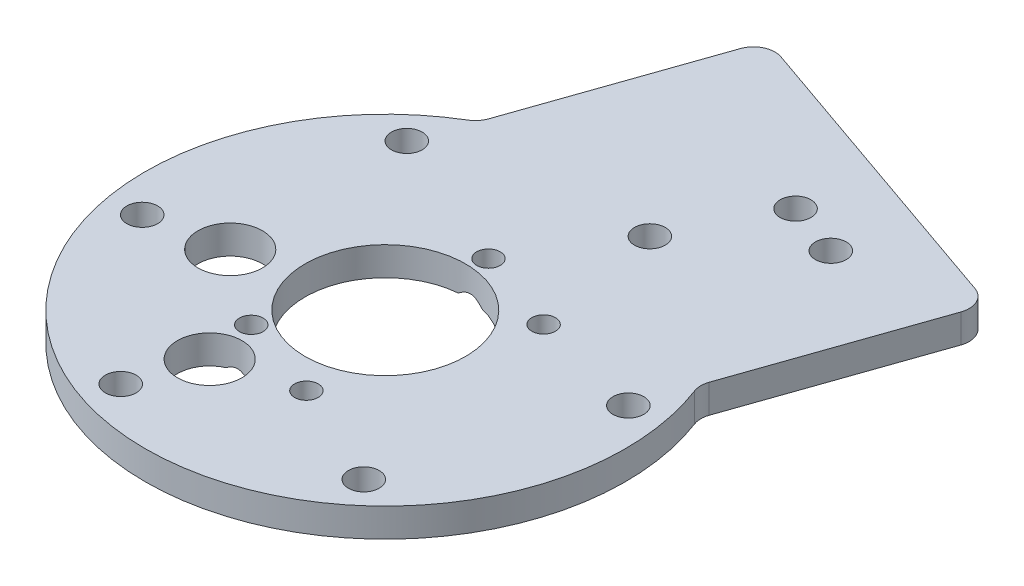
ISO-10303-21;
HEADER;
FILE_DESCRIPTION(('STEP AP214'),'2;1');
FILE_NAME('part.step','',(''),(''),'','','');
FILE_SCHEMA(('AUTOMOTIVE_DESIGN { 1 0 10303 214 1 1 1 1 }'));
ENDSEC;
DATA;
#1=APPLICATION_CONTEXT('core data for automotive mechanical design processes');
#2=APPLICATION_PROTOCOL_DEFINITION('international standard','automotive_design',2000,#1);
#3=PRODUCT_CONTEXT('',#1,'mechanical');
#4=PRODUCT('Part','Part','',(#3));
#5=PRODUCT_RELATED_PRODUCT_CATEGORY('part','',(#4));
#6=PRODUCT_DEFINITION_FORMATION('','',#4);
#7=PRODUCT_DEFINITION_CONTEXT('part definition',#1,'design');
#8=PRODUCT_DEFINITION('design','',#6,#7);
#9=PRODUCT_DEFINITION_SHAPE('','',#8);
#10=(LENGTH_UNIT() NAMED_UNIT(*) SI_UNIT(.MILLI.,.METRE.));
#11=(NAMED_UNIT(*) PLANE_ANGLE_UNIT() SI_UNIT($,.RADIAN.));
#12=(NAMED_UNIT(*) SI_UNIT($,.STERADIAN.) SOLID_ANGLE_UNIT());
#13=UNCERTAINTY_MEASURE_WITH_UNIT(LENGTH_MEASURE(1.E-05),#10,'distance_accuracy_value','');
#14=(GEOMETRIC_REPRESENTATION_CONTEXT(3) GLOBAL_UNCERTAINTY_ASSIGNED_CONTEXT((#13)) GLOBAL_UNIT_ASSIGNED_CONTEXT((#10,
#11,#12)) REPRESENTATION_CONTEXT('',''));
#15=CARTESIAN_POINT('',(0.,0.,0.));
#16=DIRECTION('',(0.,0.,1.));
#17=DIRECTION('',(1.,0.,0.));
#18=AXIS2_PLACEMENT_3D('',#15,#16,#17);
#19=CARTESIAN_POINT('',(0.,4.,0.));
#20=DIRECTION('',(0.,1.,0.));
#21=DIRECTION('',(0.,0.,1.));
#22=AXIS2_PLACEMENT_3D('',#19,#20,#21);
#23=PLANE('',#22);
#24=CARTESIAN_POINT('',(16.3561252008861,4.,-40.8959309517822));
#25=DIRECTION('',(0.,1.,0.));
#26=DIRECTION('',(0.,0.,1.));
#27=AXIS2_PLACEMENT_3D('',#24,#25,#26);
#28=CIRCLE('',#27,2.15);
#29=CARTESIAN_POINT('',(16.3561252008861,4.,-38.7459309517822));
#30=VERTEX_POINT('',#29);
#31=EDGE_CURVE('E387',#30,#30,#28,.F.);
#32=ORIENTED_EDGE('',*,*,#31,.T.);
#33=EDGE_LOOP('',(#32));
#34=FACE_BOUND('',#33,.T.);
#35=CARTESIAN_POINT('',(23.9113137051343,4.,-38.2655076654505));
#36=DIRECTION('',(0.,1.,0.));
#37=DIRECTION('',(0.,0.,1.));
#38=AXIS2_PLACEMENT_3D('',#35,#36,#37);
#39=CIRCLE('',#38,2.15);
#40=CARTESIAN_POINT('',(23.9113137051343,4.,-36.1155076654505));
#41=VERTEX_POINT('',#40);
#42=EDGE_CURVE('E715',#41,#41,#39,.F.);
#43=ORIENTED_EDGE('',*,*,#42,.T.);
#44=EDGE_LOOP('',(#43));
#45=FACE_BOUND('',#44,.T.);
#46=CARTESIAN_POINT('',(28.4859634660655,4.,-5.43598063002285));
#47=DIRECTION('',(0.,1.,0.));
#48=DIRECTION('',(0.,0.,1.));
#49=AXIS2_PLACEMENT_3D('',#46,#47,#48);
#50=CIRCLE('',#49,2.15);
#51=CARTESIAN_POINT('',(28.4859634660655,4.,-3.28598063002285));
#52=VERTEX_POINT('',#51);
#53=EDGE_CURVE('E231',#52,#52,#50,.T.);
#54=ORIENTED_EDGE('',*,*,#53,.F.);
#55=EDGE_LOOP('',(#54));
#56=FACE_BOUND('',#55,.T.);
#57=DIRECTION('',(-0.328802910791456,0.,0.944398563031025));
#58=VECTOR('',#57,1.);
#59=CARTESIAN_POINT('',(23.6099640757756,4.,8.22007276978641));
#60=LINE('',#59,#58);
#61=CARTESIAN_POINT('',(40.3789125261399,4.,-39.9442539447959));
#62=VERTEX_POINT('',#61);
#63=CARTESIAN_POINT('',(31.3087983972791,4.,-13.8927730463911));
#64=VERTEX_POINT('',#63);
#65=EDGE_CURVE('E361',#62,#64,#60,.T.);
#66=ORIENTED_EDGE('',*,*,#65,.F.);
#67=CARTESIAN_POINT('',(37.5457168370468,4.,-40.9306626771703));
#68=DIRECTION('',(0.,1.,0.));
#69=DIRECTION('',(0.,0.,1.));
#70=AXIS2_PLACEMENT_3D('',#67,#68,#69);
#71=CIRCLE('',#70,3.);
#72=CARTESIAN_POINT('',(38.5321255694212,4.,-43.7638583662633));
#73=VERTEX_POINT('',#72);
#74=EDGE_CURVE('E339',#62,#73,#71,.T.);
#75=ORIENTED_EDGE('',*,*,#74,.T.);
#76=DIRECTION('',(0.944398563031025,0.,0.328802910791456));
#77=VECTOR('',#76,1.);
#78=CARTESIAN_POINT('',(17.7553571827386,4.,-50.9975224036754));
#79=LINE('',#78,#77);
#80=CARTESIAN_POINT('',(-3.02141120394394,4.,-58.2311864410874));
#81=VERTEX_POINT('',#80);
#82=EDGE_CURVE('E396',#81,#73,#79,.T.);
#83=ORIENTED_EDGE('',*,*,#82,.F.);
#84=CARTESIAN_POINT('',(-4.0078199363183,4.,-55.3979907519943));
#85=DIRECTION('',(0.,1.,0.));
#86=DIRECTION('',(0.,0.,1.));
#87=AXIS2_PLACEMENT_3D('',#84,#85,#86);
#88=CIRCLE('',#87,3.);
#89=CARTESIAN_POINT('',(-6.84101562541137,4.,-56.3843994843687));
#90=VERTEX_POINT('',#89);
#91=EDGE_CURVE('E108',#81,#90,#88,.T.);
#92=ORIENTED_EDGE('',*,*,#91,.T.);
#93=DIRECTION('',(0.328802910791456,0.,-0.944398563031026));
#94=VECTOR('',#93,1.);
#95=CARTESIAN_POINT('',(-23.6099640757756,4.,-8.2200727697864));
#96=LINE('',#95,#94);
#97=CARTESIAN_POINT('',(-15.9111297542721,4.,-30.3329185859639));
#98=VERTEX_POINT('',#97);
#99=EDGE_CURVE('E370',#98,#90,#96,.T.);
#100=ORIENTED_EDGE('',*,*,#99,.F.);
#101=CARTESIAN_POINT('',(-18.7443254433652,4.,-31.3193273183383));
#102=DIRECTION('',(0.,1.,0.));
#103=DIRECTION('',(0.,0.,1.));
#104=AXIS2_PLACEMENT_3D('',#101,#102,#103);
#105=CIRCLE('',#104,3.);
#106=CARTESIAN_POINT('',(-17.2036959548694,4.,-28.7451360318995));
#107=VERTEX_POINT('',#106);
#108=EDGE_CURVE('E12',#98,#107,#105,.F.);
#109=ORIENTED_EDGE('',*,*,#108,.T.);
#110=CARTESIAN_POINT('',(0.,4.,0.));
#111=DIRECTION('',(0.,1.,0.));
#112=DIRECTION('',(0.,0.,1.));
#113=AXIS2_PLACEMENT_3D('',#110,#111,#112);
#114=CIRCLE('',#113,33.5);
#115=CARTESIAN_POINT('',(31.3358027916019,4.,-11.8455672471113));
#116=VERTEX_POINT('',#115);
#117=EDGE_CURVE('E245',#107,#116,#114,.T.);
#118=ORIENTED_EDGE('',*,*,#117,.T.);
#119=CARTESIAN_POINT('',(34.1419940863722,4.,-12.9063643140168));
#120=DIRECTION('',(0.,1.,0.));
#121=DIRECTION('',(0.,0.,1.));
#122=AXIS2_PLACEMENT_3D('',#119,#120,#121);
#123=CIRCLE('',#122,3.);
#124=EDGE_CURVE('E351',#116,#64,#123,.F.);
#125=ORIENTED_EDGE('',*,*,#124,.T.);
#126=EDGE_LOOP('',(#66,#75,#83,#92,#100,#109,#118,#125));
#127=FACE_BOUND('',#126,.T.);
#128=CARTESIAN_POINT('',(-18.9506790531127,4.,-21.9515776978767));
#129=DIRECTION('',(0.,1.,0.));
#130=DIRECTION('',(0.,0.,1.));
#131=AXIS2_PLACEMENT_3D('',#128,#129,#130);
#132=CIRCLE('',#131,2.15);
#133=CARTESIAN_POINT('',(-18.9506790531127,4.,-19.8015776978767));
#134=VERTEX_POINT('',#133);
#135=EDGE_CURVE('E230',#134,#134,#132,.T.);
#136=ORIENTED_EDGE('',*,*,#135,.F.);
#137=EDGE_LOOP('',(#136));
#138=FACE_BOUND('',#137,.T.);
#139=CARTESIAN_POINT('',(0.,4.,0.));
#140=DIRECTION('',(0.,1.,0.));
#141=DIRECTION('',(0.,0.,1.));
#142=AXIS2_PLACEMENT_3D('',#139,#140,#141);
#143=CIRCLE('',#142,11.2);
#144=CARTESIAN_POINT('',(0.,4.,11.2));
#145=VERTEX_POINT('',#144);
#146=EDGE_CURVE('E200',#145,#145,#143,.T.);
#147=ORIENTED_EDGE('',*,*,#146,.F.);
#148=EDGE_LOOP('',(#147));
#149=FACE_BOUND('',#148,.T.);
#150=CARTESIAN_POINT('',(-6.32945603273559,4.,18.1796723383468));
#151=DIRECTION('',(0.,1.,0.));
#152=DIRECTION('',(0.,0.,1.));
#153=AXIS2_PLACEMENT_3D('',#150,#151,#152);
#154=CIRCLE('',#153,4.5);
#155=CARTESIAN_POINT('',(-6.32945603273559,4.,22.6796723383468));
#156=VERTEX_POINT('',#155);
#157=EDGE_CURVE('E202',#156,#156,#154,.T.);
#158=ORIENTED_EDGE('',*,*,#157,.F.);
#159=EDGE_LOOP('',(#158));
#160=FACE_BOUND('',#159,.T.);
#161=CARTESIAN_POINT('',(-7.57983281090142,4.,11.1263711316335));
#162=DIRECTION('',(0.,-1.,0.));
#163=DIRECTION('',(0.,0.,-1.));
#164=AXIS2_PLACEMENT_3D('',#161,#162,#163);
#165=CIRCLE('',#164,1.65);
#166=CARTESIAN_POINT('',(-7.57983281090142,4.,9.47637113163352));
#167=VERTEX_POINT('',#166);
#168=EDGE_CURVE('E426',#167,#167,#165,.T.);
#169=ORIENTED_EDGE('',*,*,#168,.T.);
#170=EDGE_LOOP('',(#169));
#171=FACE_BOUND('',#170,.T.);
#172=CARTESIAN_POINT('',(12.774024907565,4.,-9.31795512228199));
#173=DIRECTION('',(0.,-1.,0.));
#174=DIRECTION('',(0.,0.,-1.));
#175=AXIS2_PLACEMENT_3D('',#172,#173,#174);
#176=CIRCLE('',#175,1.65);
#177=CARTESIAN_POINT('',(12.774024907565,4.,-10.967955122282));
#178=VERTEX_POINT('',#177);
#179=EDGE_CURVE('E196',#178,#178,#176,.T.);
#180=ORIENTED_EDGE('',*,*,#179,.T.);
#181=EDGE_LOOP('',(#180));
#182=FACE_BOUND('',#181,.T.);
#183=CARTESIAN_POINT('',(0.969042869677158,4.,-13.4279915071752));
#184=DIRECTION('',(0.,-1.,0.));
#185=DIRECTION('',(0.,0.,-1.));
#186=AXIS2_PLACEMENT_3D('',#183,#184,#185);
#187=CIRCLE('',#186,1.65);
#188=CARTESIAN_POINT('',(0.969042869677158,4.,-15.0779915071752));
#189=VERTEX_POINT('',#188);
#190=EDGE_CURVE('E409',#189,#189,#187,.T.);
#191=ORIENTED_EDGE('',*,*,#190,.T.);
#192=EDGE_LOOP('',(#191));
#193=FACE_BOUND('',#192,.T.);
#194=CARTESIAN_POINT('',(9.53528441295281,4.,-27.3875583278995));
#195=DIRECTION('',(0.,1.,0.));
#196=DIRECTION('',(0.,0.,1.));
#197=AXIS2_PLACEMENT_3D('',#194,#195,#196);
#198=CIRCLE('',#197,2.15);
#199=CARTESIAN_POINT('',(9.53528441295281,4.,-25.2375583278995));
#200=VERTEX_POINT('',#199);
#201=EDGE_CURVE('E227',#200,#200,#198,.T.);
#202=ORIENTED_EDGE('',*,*,#201,.F.);
#203=EDGE_LOOP('',(#202));
#204=FACE_BOUND('',#203,.T.);
#205=CARTESIAN_POINT('',(18.9506790531127,4.,21.9515776978767));
#206=DIRECTION('',(0.,1.,0.));
#207=DIRECTION('',(0.,0.,1.));
#208=AXIS2_PLACEMENT_3D('',#205,#206,#207);
#209=CIRCLE('',#208,2.15);
#210=CARTESIAN_POINT('',(18.9506790531127,4.,24.1015776978767));
#211=VERTEX_POINT('',#210);
#212=EDGE_CURVE('E234',#211,#211,#209,.T.);
#213=ORIENTED_EDGE('',*,*,#212,.F.);
#214=EDGE_LOOP('',(#213));
#215=FACE_BOUND('',#214,.T.);
#216=CARTESIAN_POINT('',(-9.53528441295281,4.,27.3875583278995));
#217=DIRECTION('',(0.,1.,0.));
#218=DIRECTION('',(0.,0.,1.));
#219=AXIS2_PLACEMENT_3D('',#216,#217,#218);
#220=CIRCLE('',#219,2.15);
#221=CARTESIAN_POINT('',(-9.53528441295281,4.,29.5375583278995));
#222=VERTEX_POINT('',#221);
#223=EDGE_CURVE('E237',#222,#222,#220,.T.);
#224=ORIENTED_EDGE('',*,*,#223,.F.);
#225=EDGE_LOOP('',(#224));
#226=FACE_BOUND('',#225,.T.);
#227=CARTESIAN_POINT('',(-28.4859634660655,4.,5.43598063002286));
#228=DIRECTION('',(0.,1.,0.));
#229=DIRECTION('',(0.,0.,1.));
#230=AXIS2_PLACEMENT_3D('',#227,#228,#229);
#231=CIRCLE('',#230,2.15);
#232=CARTESIAN_POINT('',(-28.4859634660655,4.,7.58598063002286));
#233=VERTEX_POINT('',#232);
#234=EDGE_CURVE('E218',#233,#233,#231,.T.);
#235=ORIENTED_EDGE('',*,*,#234,.F.);
#236=EDGE_LOOP('',(#235));
#237=FACE_BOUND('',#236,.T.);
#238=CARTESIAN_POINT('',(-18.1720801421436,4.,3.46778074673733));
#239=DIRECTION('',(0.,1.,0.));
#240=DIRECTION('',(0.,0.,1.));
#241=AXIS2_PLACEMENT_3D('',#238,#239,#240);
#242=CIRCLE('',#241,4.5);
#243=CARTESIAN_POINT('',(-18.1720801421436,4.,7.96778074673733));
#244=VERTEX_POINT('',#243);
#245=EDGE_CURVE('E219',#244,#244,#242,.T.);
#246=ORIENTED_EDGE('',*,*,#245,.F.);
#247=EDGE_LOOP('',(#246));
#248=FACE_BOUND('',#247,.T.);
#249=CARTESIAN_POINT('',(4.22514922698641,4.,15.2364075165266));
#250=DIRECTION('',(0.,-1.,0.));
#251=DIRECTION('',(0.,0.,-1.));
#252=AXIS2_PLACEMENT_3D('',#249,#250,#251);
#253=CIRCLE('',#252,1.65);
#254=CARTESIAN_POINT('',(4.22514922698641,4.,13.5864075165266));
#255=VERTEX_POINT('',#254);
#256=EDGE_CURVE('E418',#255,#255,#253,.T.);
#257=ORIENTED_EDGE('',*,*,#256,.T.);
#258=EDGE_LOOP('',(#257));
#259=FACE_BOUND('',#258,.T.);
#260=ADVANCED_FACE('F93',(#34,#45,#56,#127,#138,#149,#160,#171,#182,#193,#204,#215,#226,#237,
#248,#259),#23,.T.);
#261=CARTESIAN_POINT('',(0.,4.,0.));
#262=DIRECTION('',(0.,-1.,0.));
#263=DIRECTION('',(0.,0.,-1.));
#264=AXIS2_PLACEMENT_3D('',#261,#262,#263);
#265=CYLINDRICAL_SURFACE('',#264,33.5);
#266=CARTESIAN_POINT('',(0.,0.,0.));
#267=DIRECTION('',(0.,1.,0.));
#268=DIRECTION('',(0.,0.,1.));
#269=AXIS2_PLACEMENT_3D('',#266,#267,#268);
#270=CIRCLE('',#269,33.5);
#271=CARTESIAN_POINT('',(-17.2036959548694,0.,-28.7451360318995));
#272=VERTEX_POINT('',#271);
#273=CARTESIAN_POINT('',(31.3358027916019,0.,-11.8455672471113));
#274=VERTEX_POINT('',#273);
#275=EDGE_CURVE('E248',#272,#274,#270,.T.);
#276=ORIENTED_EDGE('',*,*,#275,.T.);
#277=DIRECTION('',(0.,-1.,0.));
#278=VECTOR('',#277,1.);
#279=CARTESIAN_POINT('',(31.3358027916019,4.,-11.8455672471113));
#280=LINE('',#279,#278);
#281=EDGE_CURVE('E372',#274,#116,#280,.F.);
#282=ORIENTED_EDGE('',*,*,#281,.T.);
#283=ORIENTED_EDGE('',*,*,#117,.F.);
#284=DIRECTION('',(0.,-1.,0.));
#285=VECTOR('',#284,1.);
#286=CARTESIAN_POINT('',(-17.2036959548694,4.,-28.7451360318995));
#287=LINE('',#286,#285);
#288=EDGE_CURVE('E365',#107,#272,#287,.T.);
#289=ORIENTED_EDGE('',*,*,#288,.T.);
#290=EDGE_LOOP('',(#276,#282,#283,#289));
#291=FACE_BOUND('',#290,.T.);
#292=ADVANCED_FACE('F301',(#291),#265,.T.);
#293=CARTESIAN_POINT('',(0.,0.,0.));
#294=DIRECTION('',(0.,1.,0.));
#295=DIRECTION('',(0.,0.,1.));
#296=AXIS2_PLACEMENT_3D('',#293,#294,#295);
#297=PLANE('',#296);
#298=CARTESIAN_POINT('',(16.3561252008861,0.,-40.8959309517822));
#299=DIRECTION('',(0.,-1.,0.));
#300=DIRECTION('',(0.,0.,-1.));
#301=AXIS2_PLACEMENT_3D('',#298,#299,#300);
#302=CIRCLE('',#301,2.15);
#303=CARTESIAN_POINT('',(16.3561252008861,0.,-43.0459309517822));
#304=VERTEX_POINT('',#303);
#305=EDGE_CURVE('E391',#304,#304,#302,.T.);
#306=ORIENTED_EDGE('',*,*,#305,.F.);
#307=EDGE_LOOP('',(#306));
#308=FACE_BOUND('',#307,.T.);
#309=CARTESIAN_POINT('',(23.9113137051343,0.,-38.2655076654505));
#310=DIRECTION('',(0.,-1.,0.));
#311=DIRECTION('',(0.,0.,-1.));
#312=AXIS2_PLACEMENT_3D('',#309,#310,#311);
#313=CIRCLE('',#312,2.15);
#314=CARTESIAN_POINT('',(23.9113137051343,0.,-40.4155076654505));
#315=VERTEX_POINT('',#314);
#316=EDGE_CURVE('E718',#315,#315,#313,.T.);
#317=ORIENTED_EDGE('',*,*,#316,.F.);
#318=EDGE_LOOP('',(#317));
#319=FACE_BOUND('',#318,.T.);
#320=CARTESIAN_POINT('',(28.4859634660655,0.,-5.43598063002285));
#321=DIRECTION('',(0.,1.,0.));
#322=DIRECTION('',(0.,0.,1.));
#323=AXIS2_PLACEMENT_3D('',#320,#321,#322);
#324=CIRCLE('',#323,2.15);
#325=CARTESIAN_POINT('',(28.4859634660655,0.,-3.28598063002285));
#326=VERTEX_POINT('',#325);
#327=EDGE_CURVE('E257',#326,#326,#324,.T.);
#328=ORIENTED_EDGE('',*,*,#327,.T.);
#329=EDGE_LOOP('',(#328));
#330=FACE_BOUND('',#329,.T.);
#331=DIRECTION('',(0.944398563031026,0.,0.328802910791456));
#332=VECTOR('',#331,1.);
#333=CARTESIAN_POINT('',(17.7553571827386,0.,-50.9975224036754));
#334=LINE('',#333,#332);
#335=CARTESIAN_POINT('',(-3.02141120394394,0.,-58.2311864410874));
#336=VERTEX_POINT('',#335);
#337=CARTESIAN_POINT('',(38.5321255694212,0.,-43.7638583662633));
#338=VERTEX_POINT('',#337);
#339=EDGE_CURVE('E382',#336,#338,#334,.T.);
#340=ORIENTED_EDGE('',*,*,#339,.T.);
#341=CARTESIAN_POINT('',(37.5457168370468,0.,-40.9306626771703));
#342=DIRECTION('',(0.,1.,0.));
#343=DIRECTION('',(0.,0.,1.));
#344=AXIS2_PLACEMENT_3D('',#341,#342,#343);
#345=CIRCLE('',#344,3.);
#346=CARTESIAN_POINT('',(40.3789125261399,0.,-39.9442539447959));
#347=VERTEX_POINT('',#346);
#348=EDGE_CURVE('E340',#338,#347,#345,.F.);
#349=ORIENTED_EDGE('',*,*,#348,.T.);
#350=DIRECTION('',(-0.328802910791456,0.,0.944398563031025));
#351=VECTOR('',#350,1.);
#352=CARTESIAN_POINT('',(23.6099640757756,0.,8.22007276978641));
#353=LINE('',#352,#351);
#354=CARTESIAN_POINT('',(31.3087983972791,0.,-13.8927730463911));
#355=VERTEX_POINT('',#354);
#356=EDGE_CURVE('E362',#347,#355,#353,.T.);
#357=ORIENTED_EDGE('',*,*,#356,.T.);
#358=CARTESIAN_POINT('',(34.1419940863722,0.,-12.9063643140168));
#359=DIRECTION('',(0.,1.,0.));
#360=DIRECTION('',(0.,0.,1.));
#361=AXIS2_PLACEMENT_3D('',#358,#359,#360);
#362=CIRCLE('',#361,3.);
#363=EDGE_CURVE('E349',#355,#274,#362,.T.);
#364=ORIENTED_EDGE('',*,*,#363,.T.);
#365=ORIENTED_EDGE('',*,*,#275,.F.);
#366=CARTESIAN_POINT('',(-18.7443254433652,0.,-31.3193273183383));
#367=DIRECTION('',(0.,1.,0.));
#368=DIRECTION('',(0.,0.,1.));
#369=AXIS2_PLACEMENT_3D('',#366,#367,#368);
#370=CIRCLE('',#369,3.);
#371=CARTESIAN_POINT('',(-15.9111297542721,0.,-30.3329185859639));
#372=VERTEX_POINT('',#371);
#373=EDGE_CURVE('E101',#272,#372,#370,.T.);
#374=ORIENTED_EDGE('',*,*,#373,.T.);
#375=DIRECTION('',(0.328802910791456,0.,-0.944398563031026));
#376=VECTOR('',#375,1.);
#377=CARTESIAN_POINT('',(-23.6099640757756,0.,-8.2200727697864));
#378=LINE('',#377,#376);
#379=CARTESIAN_POINT('',(-6.84101562541137,0.,-56.3843994843687));
#380=VERTEX_POINT('',#379);
#381=EDGE_CURVE('E357',#372,#380,#378,.T.);
#382=ORIENTED_EDGE('',*,*,#381,.T.);
#383=CARTESIAN_POINT('',(-4.0078199363183,0.,-55.3979907519943));
#384=DIRECTION('',(0.,1.,0.));
#385=DIRECTION('',(0.,0.,1.));
#386=AXIS2_PLACEMENT_3D('',#383,#384,#385);
#387=CIRCLE('',#386,3.);
#388=EDGE_CURVE('E343',#380,#336,#387,.F.);
#389=ORIENTED_EDGE('',*,*,#388,.T.);
#390=EDGE_LOOP('',(#340,#349,#357,#364,#365,#374,#382,#389));
#391=FACE_BOUND('',#390,.T.);
#392=CARTESIAN_POINT('',(-18.9506790531127,0.,-21.9515776978767));
#393=DIRECTION('',(0.,1.,0.));
#394=DIRECTION('',(0.,0.,1.));
#395=AXIS2_PLACEMENT_3D('',#392,#393,#394);
#396=CIRCLE('',#395,2.15);
#397=CARTESIAN_POINT('',(-18.9506790531127,0.,-19.8015776978767));
#398=VERTEX_POINT('',#397);
#399=EDGE_CURVE('E244',#398,#398,#396,.T.);
#400=ORIENTED_EDGE('',*,*,#399,.T.);
#401=EDGE_LOOP('',(#400));
#402=FACE_BOUND('',#401,.T.);
#403=CARTESIAN_POINT('',(0.,0.,0.));
#404=DIRECTION('',(0.,1.,0.));
#405=DIRECTION('',(0.,0.,1.));
#406=AXIS2_PLACEMENT_3D('',#403,#404,#405);
#407=CIRCLE('',#406,11.2);
#408=CARTESIAN_POINT('',(-0.990215530630316,0.,-11.1561406051958));
#409=VERTEX_POINT('',#408);
#410=CARTESIAN_POINT('',(-7.70454024181279,0.,8.12896424289635));
#411=VERTEX_POINT('',#410);
#412=EDGE_CURVE('E191',#409,#411,#407,.T.);
#413=ORIENTED_EDGE('',*,*,#412,.T.);
#414=CARTESIAN_POINT('',(-7.57983281090142,0.,11.1263711316335));
#415=DIRECTION('',(0.,-1.,0.));
#416=DIRECTION('',(0.,0.,-1.));
#417=AXIS2_PLACEMENT_3D('',#414,#415,#416);
#418=CIRCLE('',#417,3.);
#419=CARTESIAN_POINT('',(-8.16142767085961,0.,14.0694558091225));
#420=VERTEX_POINT('',#419);
#421=EDGE_CURVE('E421',#420,#411,#418,.T.);
#422=ORIENTED_EDGE('',*,*,#421,.F.);
#423=CARTESIAN_POINT('',(-6.32945603273559,0.,18.1796723383468));
#424=DIRECTION('',(0.,1.,0.));
#425=DIRECTION('',(0.,0.,1.));
#426=AXIS2_PLACEMENT_3D('',#423,#424,#425);
#427=CIRCLE('',#426,4.5);
#428=CARTESIAN_POINT('',(-6.02199980867246,0.,13.6901878835029));
#429=VERTEX_POINT('',#428);
#430=EDGE_CURVE('E222',#420,#429,#427,.T.);
#431=ORIENTED_EDGE('',*,*,#430,.T.);
#432=CARTESIAN_POINT('',(-4.74478626564165,0.,10.1452946380762));
#433=VERTEX_POINT('',#432);
#434=EDGE_CURVE('E422',#433,#429,#418,.T.);
#435=ORIENTED_EDGE('',*,*,#434,.F.);
#436=CARTESIAN_POINT('',(2.58179827200503,0.,-10.8983630735387));
#437=VERTEX_POINT('',#436);
#438=EDGE_CURVE('E194',#433,#437,#407,.T.);
#439=ORIENTED_EDGE('',*,*,#438,.T.);
#440=CARTESIAN_POINT('',(0.969042869677158,0.,-13.4279915071752));
#441=DIRECTION('',(0.,-1.,0.));
#442=DIRECTION('',(0.,0.,-1.));
#443=AXIS2_PLACEMENT_3D('',#440,#441,#442);
#444=CIRCLE('',#443,3.);
#445=EDGE_CURVE('E180',#409,#437,#444,.T.);
#446=ORIENTED_EDGE('',*,*,#445,.F.);
#447=EDGE_LOOP('',(#413,#422,#431,#435,#439,#446));
#448=FACE_BOUND('',#447,.T.);
#449=CARTESIAN_POINT('',(4.22514922698641,0.,15.2364075165266));
#450=DIRECTION('',(0.,-1.,0.));
#451=DIRECTION('',(0.,0.,-1.));
#452=AXIS2_PLACEMENT_3D('',#449,#450,#451);
#453=CIRCLE('',#452,3.);
#454=CARTESIAN_POINT('',(4.22514922698641,0.,12.2364075165266));
#455=VERTEX_POINT('',#454);
#456=EDGE_CURVE('E412',#455,#455,#453,.T.);
#457=ORIENTED_EDGE('',*,*,#456,.F.);
#458=EDGE_LOOP('',(#457));
#459=FACE_BOUND('',#458,.T.);
#460=CARTESIAN_POINT('',(-18.1720801421436,0.,3.46778074673733));
#461=DIRECTION('',(0.,1.,0.));
#462=DIRECTION('',(0.,0.,1.));
#463=AXIS2_PLACEMENT_3D('',#460,#461,#462);
#464=CIRCLE('',#463,4.5);
#465=CARTESIAN_POINT('',(-18.1720801421436,0.,7.96778074673733));
#466=VERTEX_POINT('',#465);
#467=EDGE_CURVE('E215',#466,#466,#464,.T.);
#468=ORIENTED_EDGE('',*,*,#467,.T.);
#469=EDGE_LOOP('',(#468));
#470=FACE_BOUND('',#469,.T.);
#471=CARTESIAN_POINT('',(-28.4859634660655,0.,5.43598063002286));
#472=DIRECTION('',(0.,1.,0.));
#473=DIRECTION('',(0.,0.,1.));
#474=AXIS2_PLACEMENT_3D('',#471,#472,#473);
#475=CIRCLE('',#474,2.15);
#476=CARTESIAN_POINT('',(-28.4859634660655,0.,7.58598063002286));
#477=VERTEX_POINT('',#476);
#478=EDGE_CURVE('E251',#477,#477,#475,.T.);
#479=ORIENTED_EDGE('',*,*,#478,.T.);
#480=EDGE_LOOP('',(#479));
#481=FACE_BOUND('',#480,.T.);
#482=CARTESIAN_POINT('',(-9.53528441295281,0.,27.3875583278995));
#483=DIRECTION('',(0.,1.,0.));
#484=DIRECTION('',(0.,0.,1.));
#485=AXIS2_PLACEMENT_3D('',#482,#483,#484);
#486=CIRCLE('',#485,2.15);
#487=CARTESIAN_POINT('',(-9.53528441295281,0.,29.5375583278995));
#488=VERTEX_POINT('',#487);
#489=EDGE_CURVE('E263',#488,#488,#486,.T.);
#490=ORIENTED_EDGE('',*,*,#489,.T.);
#491=EDGE_LOOP('',(#490));
#492=FACE_BOUND('',#491,.T.);
#493=CARTESIAN_POINT('',(18.9506790531127,0.,21.9515776978767));
#494=DIRECTION('',(0.,1.,0.));
#495=DIRECTION('',(0.,0.,1.));
#496=AXIS2_PLACEMENT_3D('',#493,#494,#495);
#497=CIRCLE('',#496,2.15);
#498=CARTESIAN_POINT('',(18.9506790531127,0.,24.1015776978767));
#499=VERTEX_POINT('',#498);
#500=EDGE_CURVE('E260',#499,#499,#497,.T.);
#501=ORIENTED_EDGE('',*,*,#500,.T.);
#502=EDGE_LOOP('',(#501));
#503=FACE_BOUND('',#502,.T.);
#504=CARTESIAN_POINT('',(9.53528441295281,0.,-27.3875583278995));
#505=DIRECTION('',(0.,1.,0.));
#506=DIRECTION('',(0.,0.,1.));
#507=AXIS2_PLACEMENT_3D('',#504,#505,#506);
#508=CIRCLE('',#507,2.15);
#509=CARTESIAN_POINT('',(9.53528441295281,0.,-25.2375583278995));
#510=VERTEX_POINT('',#509);
#511=EDGE_CURVE('E254',#510,#510,#508,.T.);
#512=ORIENTED_EDGE('',*,*,#511,.T.);
#513=EDGE_LOOP('',(#512));
#514=FACE_BOUND('',#513,.T.);
#515=CARTESIAN_POINT('',(12.774024907565,0.,-9.31795512228199));
#516=DIRECTION('',(0.,-1.,0.));
#517=DIRECTION('',(0.,0.,-1.));
#518=AXIS2_PLACEMENT_3D('',#515,#516,#517);
#519=CIRCLE('',#518,3.);
#520=CARTESIAN_POINT('',(12.774024907565,0.,-12.317955122282));
#521=VERTEX_POINT('',#520);
#522=EDGE_CURVE('E398',#521,#521,#519,.T.);
#523=ORIENTED_EDGE('',*,*,#522,.F.);
#524=EDGE_LOOP('',(#523));
#525=FACE_BOUND('',#524,.T.);
#526=ADVANCED_FACE('F188',(#308,#319,#330,#391,#402,#448,#459,#470,#481,#492,#503,#514,#525),
#297,.F.);
#527=CARTESIAN_POINT('',(-18.9506790531127,-20.,-21.9515776978767));
#528=DIRECTION('',(0.,1.,0.));
#529=DIRECTION('',(0.,0.,1.));
#530=AXIS2_PLACEMENT_3D('',#527,#528,#529);
#531=CYLINDRICAL_SURFACE('',#530,2.15);
#532=ORIENTED_EDGE('',*,*,#135,.T.);
#533=EDGE_LOOP('',(#532));
#534=FACE_BOUND('',#533,.T.);
#535=ORIENTED_EDGE('',*,*,#399,.F.);
#536=EDGE_LOOP('',(#535));
#537=FACE_BOUND('',#536,.T.);
#538=ADVANCED_FACE('F314',(#534,#537),#531,.F.);
#539=CARTESIAN_POINT('',(9.53528441295281,-20.,-27.3875583278995));
#540=DIRECTION('',(0.,1.,0.));
#541=DIRECTION('',(0.,0.,1.));
#542=AXIS2_PLACEMENT_3D('',#539,#540,#541);
#543=CYLINDRICAL_SURFACE('',#542,2.15);
#544=ORIENTED_EDGE('',*,*,#201,.T.);
#545=EDGE_LOOP('',(#544));
#546=FACE_BOUND('',#545,.T.);
#547=ORIENTED_EDGE('',*,*,#511,.F.);
#548=EDGE_LOOP('',(#547));
#549=FACE_BOUND('',#548,.T.);
#550=ADVANCED_FACE('F521',(#546,#549),#543,.F.);
#551=CARTESIAN_POINT('',(28.4859634660655,-20.,-5.43598063002285));
#552=DIRECTION('',(0.,1.,0.));
#553=DIRECTION('',(0.,0.,1.));
#554=AXIS2_PLACEMENT_3D('',#551,#552,#553);
#555=CYLINDRICAL_SURFACE('',#554,2.15);
#556=ORIENTED_EDGE('',*,*,#53,.T.);
#557=EDGE_LOOP('',(#556));
#558=FACE_BOUND('',#557,.T.);
#559=ORIENTED_EDGE('',*,*,#327,.F.);
#560=EDGE_LOOP('',(#559));
#561=FACE_BOUND('',#560,.T.);
#562=ADVANCED_FACE('F527',(#558,#561),#555,.F.);
#563=CARTESIAN_POINT('',(18.9506790531127,-20.,21.9515776978767));
#564=DIRECTION('',(0.,1.,0.));
#565=DIRECTION('',(0.,0.,1.));
#566=AXIS2_PLACEMENT_3D('',#563,#564,#565);
#567=CYLINDRICAL_SURFACE('',#566,2.15);
#568=ORIENTED_EDGE('',*,*,#212,.T.);
#569=EDGE_LOOP('',(#568));
#570=FACE_BOUND('',#569,.T.);
#571=ORIENTED_EDGE('',*,*,#500,.F.);
#572=EDGE_LOOP('',(#571));
#573=FACE_BOUND('',#572,.T.);
#574=ADVANCED_FACE('F530',(#570,#573),#567,.F.);
#575=CARTESIAN_POINT('',(-9.53528441295281,-20.,27.3875583278995));
#576=DIRECTION('',(0.,1.,0.));
#577=DIRECTION('',(0.,0.,1.));
#578=AXIS2_PLACEMENT_3D('',#575,#576,#577);
#579=CYLINDRICAL_SURFACE('',#578,2.15);
#580=ORIENTED_EDGE('',*,*,#223,.T.);
#581=EDGE_LOOP('',(#580));
#582=FACE_BOUND('',#581,.T.);
#583=ORIENTED_EDGE('',*,*,#489,.F.);
#584=EDGE_LOOP('',(#583));
#585=FACE_BOUND('',#584,.T.);
#586=ADVANCED_FACE('F633',(#582,#585),#579,.F.);
#587=CARTESIAN_POINT('',(-28.4859634660655,-20.,5.43598063002286));
#588=DIRECTION('',(0.,1.,0.));
#589=DIRECTION('',(0.,0.,1.));
#590=AXIS2_PLACEMENT_3D('',#587,#588,#589);
#591=CYLINDRICAL_SURFACE('',#590,2.15);
#592=ORIENTED_EDGE('',*,*,#234,.T.);
#593=EDGE_LOOP('',(#592));
#594=FACE_BOUND('',#593,.T.);
#595=ORIENTED_EDGE('',*,*,#478,.F.);
#596=EDGE_LOOP('',(#595));
#597=FACE_BOUND('',#596,.T.);
#598=ADVANCED_FACE('F437',(#594,#597),#591,.F.);
#599=CARTESIAN_POINT('',(-6.32945603273559,0.,18.1796723383468));
#600=DIRECTION('',(0.,1.,0.));
#601=DIRECTION('',(0.,0.,1.));
#602=AXIS2_PLACEMENT_3D('',#599,#600,#601);
#603=CYLINDRICAL_SURFACE('',#602,4.5);
#604=ORIENTED_EDGE('',*,*,#430,.F.);
#605=CARTESIAN_POINT('',(-8.16174452346892,-0.00020000000000047,14.0695970486804));
#606=CARTESIAN_POINT('',(-8.06484145810903,0.0609726425144009,14.0263563699747));
#607=CARTESIAN_POINT('',(-7.96285005495678,0.117596678613043,13.9850402317614));
#608=CARTESIAN_POINT('',(-7.74848908094933,0.215447663379432,13.9077414549993));
#609=CARTESIAN_POINT('',(-7.63601626776637,0.256495472066935,13.8718235802537));
#610=CARTESIAN_POINT('',(-7.43321253865754,0.307537075139783,13.8162242411453));
#611=CARTESIAN_POINT('',(-7.3447846025454,0.322845060036785,13.7947532355617));
#612=CARTESIAN_POINT('',(-7.16604162552522,0.338384840784985,13.7571846459147));
#613=CARTESIAN_POINT('',(-7.07574232772437,0.338712712175901,13.7410534777604));
#614=CARTESIAN_POINT('',(-6.89565047067019,0.324500116636169,13.7145058071818));
#615=CARTESIAN_POINT('',(-6.8058574114573,0.309978641861595,13.7040820312129));
#616=CARTESIAN_POINT('',(-6.62838983773297,0.268093639649458,13.688721737527));
#617=CARTESIAN_POINT('',(-6.54073090610416,0.240655018015356,13.6838178829155));
#618=CARTESIAN_POINT('',(-6.37943780713918,0.179797901922384,13.6793139374491));
#619=CARTESIAN_POINT('',(-6.30538244842859,0.147491197049042,13.679148309828));
#620=CARTESIAN_POINT('',(-6.16097849980457,0.0773621022481874,13.6822563137011));
#621=CARTESIAN_POINT('',(-6.09059827666652,0.0396037548149205,13.6854924310141));
#622=CARTESIAN_POINT('',(-6.02165371363389,-0.000200000000028218,13.6902115987529));
#623=B_SPLINE_CURVE_WITH_KNOTS('',3,(#605,#606,#607,#608,#609,#610,#611,#612,#613,#614,#615,
#616,#617,#618,#619,#620,#621,#622),.UNSPECIFIED.,.F.,.F.,(4,2,2,2,2,2,2,2,4),(0.,
0.368985446945573,0.742094445398462,1.01761569152284,1.29136962171363,1.56477386092259,
1.83978755105083,2.08181954728654,2.32121015876595),.UNSPECIFIED.);
#624=EDGE_CURVE('E204',#420,#429,#623,.T.);
#625=ORIENTED_EDGE('',*,*,#624,.T.);
#626=EDGE_LOOP('',(#604,#625));
#627=FACE_BOUND('',#626,.T.);
#628=ORIENTED_EDGE('',*,*,#157,.T.);
#629=EDGE_LOOP('',(#628));
#630=FACE_BOUND('',#629,.T.);
#631=ADVANCED_FACE('F432',(#627,#630),#603,.F.);
#632=CARTESIAN_POINT('',(-18.1720801421436,0.,3.46778074673733));
#633=DIRECTION('',(0.,1.,0.));
#634=DIRECTION('',(0.,0.,1.));
#635=AXIS2_PLACEMENT_3D('',#632,#633,#634);
#636=CYLINDRICAL_SURFACE('',#635,4.5);
#637=ORIENTED_EDGE('',*,*,#467,.F.);
#638=EDGE_LOOP('',(#637));
#639=FACE_BOUND('',#638,.T.);
#640=ORIENTED_EDGE('',*,*,#245,.T.);
#641=EDGE_LOOP('',(#640));
#642=FACE_BOUND('',#641,.T.);
#643=ADVANCED_FACE('F436',(#639,#642),#636,.F.);
#644=CARTESIAN_POINT('',(0.,0.,0.));
#645=DIRECTION('',(0.,1.,0.));
#646=DIRECTION('',(0.,0.,1.));
#647=AXIS2_PLACEMENT_3D('',#644,#645,#646);
#648=CYLINDRICAL_SURFACE('',#647,11.2);
#649=ORIENTED_EDGE('',*,*,#146,.T.);
#650=EDGE_LOOP('',(#649));
#651=FACE_BOUND('',#650,.T.);
#652=CARTESIAN_POINT('',(-4.74453377257196,-0.000200000000001332,10.1454127210737));
#653=CARTESIAN_POINT('',(-4.81313352346863,0.0540805407247798,10.113324306019));
#654=CARTESIAN_POINT('',(-4.88222661705322,0.107198093889317,10.080171916277));
#655=CARTESIAN_POINT('',(-5.02193073321672,0.210248743264971,10.0113105463179));
#656=CARTESIAN_POINT('',(-5.09254625452358,0.260169931609948,9.97559295128671));
#657=CARTESIAN_POINT('',(-5.23729856638955,0.35687567948566,9.90038024454487));
#658=CARTESIAN_POINT('',(-5.31147884281887,0.403537129908889,9.86080854149232));
#659=CARTESIAN_POINT('',(-5.46169744891598,0.490405115342623,9.77840408556674));
#660=CARTESIAN_POINT('',(-5.53773301148625,0.530620658296247,9.73557600906245));
#661=CARTESIAN_POINT('',(-5.66183549329927,0.588418297457506,9.66367308286959));
#662=CARTESIAN_POINT('',(-5.70928545814363,0.608721849875333,9.63572335523145));
#663=CARTESIAN_POINT('',(-5.80486563136725,0.645469657107595,9.57844653805835));
#664=CARTESIAN_POINT('',(-5.85299585806872,0.661913807761839,9.54911941137482));
#665=CARTESIAN_POINT('',(-5.94933644091024,0.690187670897239,9.4893929410023));
#666=CARTESIAN_POINT('',(-5.99754237574582,0.702056665472047,9.45900528499716));
#667=CARTESIAN_POINT('',(-6.09415772121572,0.720837187768296,9.39704914763288));
#668=CARTESIAN_POINT('',(-6.1425670786592,0.72774993907073,9.36548095974582));
#669=CARTESIAN_POINT('',(-6.23972848894629,0.73630308684354,9.30103335945209));
#670=CARTESIAN_POINT('',(-6.28847875224237,0.737886955878245,9.26814361122823));
#671=CARTESIAN_POINT('',(-6.38536196856586,0.735533039784333,9.20166313880563));
#672=CARTESIAN_POINT('',(-6.433494916353,0.731595207814203,9.16807240866273));
#673=CARTESIAN_POINT('',(-6.52888854680799,0.718398480891082,9.10038715952167));
#674=CARTESIAN_POINT('',(-6.57614595058385,0.709122622365206,9.06629137365075));
#675=CARTESIAN_POINT('',(-6.66935385443555,0.685707525870747,8.99794774457364));
#676=CARTESIAN_POINT('',(-6.71530349181725,0.671565154594134,8.96369981746876));
#677=CARTESIAN_POINT('',(-6.82466571317765,0.63220195854385,8.88090156544531));
#678=CARTESIAN_POINT('',(-6.88731946865609,0.604822437421369,8.83237718413559));
#679=CARTESIAN_POINT('',(-7.00949922190891,0.543314265539345,8.73573114569181));
#680=CARTESIAN_POINT('',(-7.06902423358207,0.509183502912186,8.68760961949763));
#681=CARTESIAN_POINT('',(-7.18532625884063,0.435628114527908,8.59166965069142));
#682=CARTESIAN_POINT('',(-7.24209375624481,0.39618671469981,8.5438526928369));
#683=CARTESIAN_POINT('',(-7.35295431119847,0.313341512349065,8.44863305564298));
#684=CARTESIAN_POINT('',(-7.4070481806464,0.269938924255882,8.40123025418164));
#685=CARTESIAN_POINT('',(-7.50230112835138,0.189073941200089,8.31617098444768));
#686=CARTESIAN_POINT('',(-7.54388322879061,0.152159849018824,8.27846155353516));
#687=CARTESIAN_POINT('',(-7.62541977390739,0.0769661786315655,8.20341475558314));
#688=CARTESIAN_POINT('',(-7.66538300814726,0.0386969791825113,8.166076559766));
#689=CARTESIAN_POINT('',(-7.7047425494936,-0.000200000000135815,8.1287724931888));
#690=B_SPLINE_CURVE_WITH_KNOTS('',3,(#652,#653,#654,#655,#656,#657,#658,#659,#660,#661,#662,
#663,#664,#665,#666,#667,#668,#669,#670,#671,#672,#673,#674,#675,#676,#677,#678,#679,#680,#681,
#682,#683,#684,#685,#686,#687,#688,#689),.UNSPECIFIED.,.F.,.F.,(4,2,2,2,2,2,2,2,2,2,2,2,2,2,2,2,
2,2,4),(0.,0.279595965294549,0.560179284565922,0.848435607731407,1.1362855223025,
1.31224513823615,1.4882095025431,1.66262747674567,1.83700237637325,2.01322126565701,
2.18944164984414,2.36622515712299,2.54312270023237,2.7942145499002,3.04538506861348,
3.29736840170618,3.54927473907665,3.75079456245296,3.951010683202),.UNSPECIFIED.);
#691=EDGE_CURVE('E185',#433,#411,#690,.T.);
#692=ORIENTED_EDGE('',*,*,#691,.T.);
#693=ORIENTED_EDGE('',*,*,#412,.F.);
#694=CARTESIAN_POINT('',(-0.990493179410696,-0.000200000000000074,-11.1561159576952));
#695=CARTESIAN_POINT('',(-0.915055625076767,0.0540805407247968,-11.1628068171257));
#696=CARTESIAN_POINT('',(-0.838657225706251,0.107198093889352,-11.1688252139486));
#697=CARTESIAN_POINT('',(-0.683264095361973,0.210248743265046,-11.1794131026647));
#698=CARTESIAN_POINT('',(-0.604261148533373,0.260169931610046,-11.1839774029008));
#699=CARTESIAN_POINT('',(-0.441313390196875,0.356875679485814,-11.1916070227521));
#700=CARTESIAN_POINT('',(-0.357292516773014,0.403537129909075,-11.1946279369677));
#701=CARTESIAN_POINT('',(-0.186006602318171,0.490405115342883,-11.1987823904216));
#702=CARTESIAN_POINT('',(-0.0987463022090515,0.530620658296549,-11.1999185846388));
#703=CARTESIAN_POINT('',(0.0446811753508666,0.588418297457888,-11.2000429552003));
#704=CARTESIAN_POINT('',(0.0997499047545814,0.608721849875748,-11.1996944144751));
#705=CARTESIAN_POINT('',(0.211167187599008,0.645469657108082,-11.1981476816281));
#706=CARTESIAN_POINT('',(0.267515775536418,0.661913807762363,-11.1969494665781));
#707=CARTESIAN_POINT('',(0.380820576442932,0.69018767089784,-11.1936659841378));
#708=CARTESIAN_POINT('',(0.437767097722633,0.702056665472686,-11.1915886047792));
#709=CARTESIAN_POINT('',(0.552428967529841,0.720837187769015,-11.1865147946049));
#710=CARTESIAN_POINT('',(0.61014412271322,0.727749939071489,-11.1835185908867));
#711=CARTESIAN_POINT('',(0.726529130653824,0.736303086844382,-11.1765642570389));
#712=CARTESIAN_POINT('',(0.785202625054006,0.737886955879129,-11.1725962897333));
#713=CARTESIAN_POINT('',(0.902367685187349,0.735533039785293,-11.1637441994338));
#714=CARTESIAN_POINT('',(0.960859249372947,0.731595207815198,-11.1588600686682));
#715=CARTESIAN_POINT('',(1.07734095555591,0.718398480892142,-11.1482181793912));
#716=CARTESIAN_POINT('',(1.13532889793452,0.709122622366297,-11.1424576790235));
#717=CARTESIAN_POINT('',(1.25025087958846,0.685707525871895,-11.130149019121));
#718=CARTESIAN_POINT('',(1.30718421490503,0.671565154595307,-11.1236003538965));
#719=CARTESIAN_POINT('',(1.44333411356636,0.632201958545106,-11.106901518802));
#720=CARTESIAN_POINT('',(1.52188139561004,0.60482243742269,-11.0963928014407));
#721=CARTESIAN_POINT('',(1.67606879324169,0.543314265540804,-11.0741533036198));
#722=CARTESIAN_POINT('',(1.75170799028128,0.509183502913718,-11.0624221413099));
#723=CARTESIAN_POINT('',(1.90045767094677,0.435628114529588,-11.0378422471757));
#724=CARTESIAN_POINT('',(1.97355917926597,0.396186714701563,-11.0249900216314));
#725=CARTESIAN_POINT('',(2.11724127015485,0.313341512350967,-10.9983010967798));
#726=CARTESIAN_POINT('',(2.18782261619035,0.269938924257859,-10.9844646994872));
#727=CARTESIAN_POINT('',(2.31290561259656,0.189073941201851,-10.9587266454753));
#728=CARTESIAN_POINT('',(2.36779969511781,0.152159849020277,-10.9469915715135));
#729=CARTESIAN_POINT('',(2.4759934168329,0.0769661786323756,-10.9230259992466));
#730=CARTESIAN_POINT('',(2.52930107358624,0.0386969791829887,-10.9107991971582));
#731=CARTESIAN_POINT('',(2.58206950483945,-0.000200000000000083,-10.8982988155114));
#732=B_SPLINE_CURVE_WITH_KNOTS('',3,(#694,#695,#696,#697,#698,#699,#700,#701,#702,#703,#704,
#705,#706,#707,#708,#709,#710,#711,#712,#713,#714,#715,#716,#717,#718,#719,#720,#721,#722,#723,
#724,#725,#726,#727,#728,#729,#730,#731),.UNSPECIFIED.,.F.,.F.,(4,2,2,2,2,2,2,2,2,2,2,2,2,2,2,2,
2,2,4),(0.,0.27959596529454,0.560179284565905,0.848435607731384,1.13628552230247,
1.31224513823614,1.48820950254311,1.66262747674569,1.83700237637329,2.01322126565707,
2.18944164984423,2.3662251571231,2.5431227002325,2.79421454990003,3.04538506861301,
3.29736840170542,3.54927473907559,3.75079456245363,3.95101068320438),.UNSPECIFIED.);
#733=EDGE_CURVE('E177',#409,#437,#732,.T.);
#734=ORIENTED_EDGE('',*,*,#733,.T.);
#735=ORIENTED_EDGE('',*,*,#438,.F.);
#736=EDGE_LOOP('',(#692,#693,#734,#735));
#737=FACE_BOUND('',#736,.T.);
#738=ADVANCED_FACE('F199',(#651,#737),#648,.F.);
#739=CARTESIAN_POINT('',(-7.57983281090142,0.,11.1263711316335));
#740=DIRECTION('',(0.,-1.,0.));
#741=DIRECTION('',(0.,0.,-1.));
#742=AXIS2_PLACEMENT_3D('',#739,#740,#741);
#743=CONICAL_SURFACE('',#742,3.,0.785398163397449);
#744=CARTESIAN_POINT('',(-7.57983281090142,1.34999999999999,11.1263711316335));
#745=DIRECTION('',(0.,-1.,0.));
#746=DIRECTION('',(0.,0.,-1.));
#747=AXIS2_PLACEMENT_3D('',#744,#745,#746);
#748=CIRCLE('',#747,1.65);
#749=CARTESIAN_POINT('',(-7.57983281090142,1.34999999999999,9.47637113163352));
#750=VERTEX_POINT('',#749);
#751=EDGE_CURVE('E424',#750,#750,#748,.T.);
#752=ORIENTED_EDGE('',*,*,#751,.F.);
#753=EDGE_LOOP('',(#752));
#754=FACE_BOUND('',#753,.T.);
#755=ORIENTED_EDGE('',*,*,#421,.T.);
#756=ORIENTED_EDGE('',*,*,#691,.F.);
#757=ORIENTED_EDGE('',*,*,#434,.T.);
#758=ORIENTED_EDGE('',*,*,#624,.F.);
#759=EDGE_LOOP('',(#755,#756,#757,#758));
#760=FACE_BOUND('',#759,.T.);
#761=ADVANCED_FACE('F282',(#754,#760),#743,.F.);
#762=CARTESIAN_POINT('',(-7.57983281090142,0.,11.1263711316335));
#763=DIRECTION('',(0.,-1.,0.));
#764=DIRECTION('',(0.,0.,-1.));
#765=AXIS2_PLACEMENT_3D('',#762,#763,#764);
#766=CYLINDRICAL_SURFACE('',#765,1.65);
#767=ORIENTED_EDGE('',*,*,#168,.F.);
#768=EDGE_LOOP('',(#767));
#769=FACE_BOUND('',#768,.T.);
#770=ORIENTED_EDGE('',*,*,#751,.T.);
#771=EDGE_LOOP('',(#770));
#772=FACE_BOUND('',#771,.T.);
#773=ADVANCED_FACE('F286',(#769,#772),#766,.F.);
#774=CARTESIAN_POINT('',(4.22514922698641,0.,15.2364075165266));
#775=DIRECTION('',(0.,-1.,0.));
#776=DIRECTION('',(0.,0.,-1.));
#777=AXIS2_PLACEMENT_3D('',#774,#775,#776);
#778=CYLINDRICAL_SURFACE('',#777,1.65);
#779=ORIENTED_EDGE('',*,*,#256,.F.);
#780=EDGE_LOOP('',(#779));
#781=FACE_BOUND('',#780,.T.);
#782=CARTESIAN_POINT('',(4.22514922698641,1.34999999999999,15.2364075165266));
#783=DIRECTION('',(0.,-1.,0.));
#784=DIRECTION('',(0.,0.,-1.));
#785=AXIS2_PLACEMENT_3D('',#782,#783,#784);
#786=CIRCLE('',#785,1.65);
#787=CARTESIAN_POINT('',(4.22514922698641,1.34999999999999,13.5864075165266));
#788=VERTEX_POINT('',#787);
#789=EDGE_CURVE('E415',#788,#788,#786,.T.);
#790=ORIENTED_EDGE('',*,*,#789,.T.);
#791=EDGE_LOOP('',(#790));
#792=FACE_BOUND('',#791,.T.);
#793=ADVANCED_FACE('F288',(#781,#792),#778,.F.);
#794=CARTESIAN_POINT('',(4.22514922698641,0.,15.2364075165266));
#795=DIRECTION('',(0.,-1.,0.));
#796=DIRECTION('',(0.,0.,-1.));
#797=AXIS2_PLACEMENT_3D('',#794,#795,#796);
#798=CONICAL_SURFACE('',#797,3.,0.785398163397449);
#799=ORIENTED_EDGE('',*,*,#789,.F.);
#800=EDGE_LOOP('',(#799));
#801=FACE_BOUND('',#800,.T.);
#802=ORIENTED_EDGE('',*,*,#456,.T.);
#803=EDGE_LOOP('',(#802));
#804=FACE_BOUND('',#803,.T.);
#805=ADVANCED_FACE('F296',(#801,#804),#798,.F.);
#806=CARTESIAN_POINT('',(0.969042869677158,0.,-13.4279915071752));
#807=DIRECTION('',(0.,-1.,0.));
#808=DIRECTION('',(0.,0.,-1.));
#809=AXIS2_PLACEMENT_3D('',#806,#807,#808);
#810=CONICAL_SURFACE('',#809,3.,0.78539816339745);
#811=CARTESIAN_POINT('',(0.969042869677158,1.34999999999999,-13.4279915071752));
#812=DIRECTION('',(0.,-1.,0.));
#813=DIRECTION('',(0.,0.,-1.));
#814=AXIS2_PLACEMENT_3D('',#811,#812,#813);
#815=CIRCLE('',#814,1.65);
#816=CARTESIAN_POINT('',(0.969042869677158,1.34999999999999,-15.0779915071752));
#817=VERTEX_POINT('',#816);
#818=EDGE_CURVE('E195',#817,#817,#815,.T.);
#819=ORIENTED_EDGE('',*,*,#818,.F.);
#820=EDGE_LOOP('',(#819));
#821=FACE_BOUND('',#820,.T.);
#822=ORIENTED_EDGE('',*,*,#445,.T.);
#823=ORIENTED_EDGE('',*,*,#733,.F.);
#824=EDGE_LOOP('',(#822,#823));
#825=FACE_BOUND('',#824,.T.);
#826=ADVANCED_FACE('F179',(#821,#825),#810,.F.);
#827=CARTESIAN_POINT('',(0.969042869677158,0.,-13.4279915071752));
#828=DIRECTION('',(0.,-1.,0.));
#829=DIRECTION('',(0.,0.,-1.));
#830=AXIS2_PLACEMENT_3D('',#827,#828,#829);
#831=CYLINDRICAL_SURFACE('',#830,1.65);
#832=ORIENTED_EDGE('',*,*,#190,.F.);
#833=EDGE_LOOP('',(#832));
#834=FACE_BOUND('',#833,.T.);
#835=ORIENTED_EDGE('',*,*,#818,.T.);
#836=EDGE_LOOP('',(#835));
#837=FACE_BOUND('',#836,.T.);
#838=ADVANCED_FACE('F487',(#834,#837),#831,.F.);
#839=CARTESIAN_POINT('',(12.774024907565,0.,-9.31795512228199));
#840=DIRECTION('',(0.,-1.,0.));
#841=DIRECTION('',(0.,0.,-1.));
#842=AXIS2_PLACEMENT_3D('',#839,#840,#841);
#843=CYLINDRICAL_SURFACE('',#842,1.65);
#844=ORIENTED_EDGE('',*,*,#179,.F.);
#845=EDGE_LOOP('',(#844));
#846=FACE_BOUND('',#845,.T.);
#847=CARTESIAN_POINT('',(12.774024907565,1.34999999999999,-9.31795512228199));
#848=DIRECTION('',(0.,-1.,0.));
#849=DIRECTION('',(0.,0.,-1.));
#850=AXIS2_PLACEMENT_3D('',#847,#848,#849);
#851=CIRCLE('',#850,1.65);
#852=CARTESIAN_POINT('',(12.774024907565,1.34999999999999,-10.967955122282));
#853=VERTEX_POINT('',#852);
#854=EDGE_CURVE('E402',#853,#853,#851,.T.);
#855=ORIENTED_EDGE('',*,*,#854,.T.);
#856=EDGE_LOOP('',(#855));
#857=FACE_BOUND('',#856,.T.);
#858=ADVANCED_FACE('F478',(#846,#857),#843,.F.);
#859=CARTESIAN_POINT('',(12.774024907565,0.,-9.31795512228199));
#860=DIRECTION('',(0.,-1.,0.));
#861=DIRECTION('',(0.,0.,-1.));
#862=AXIS2_PLACEMENT_3D('',#859,#860,#861);
#863=CONICAL_SURFACE('',#862,3.,0.785398163397449);
#864=ORIENTED_EDGE('',*,*,#854,.F.);
#865=EDGE_LOOP('',(#864));
#866=FACE_BOUND('',#865,.T.);
#867=ORIENTED_EDGE('',*,*,#522,.T.);
#868=EDGE_LOOP('',(#867));
#869=FACE_BOUND('',#868,.T.);
#870=ADVANCED_FACE('F475',(#866,#869),#863,.F.);
#871=CARTESIAN_POINT('',(23.6099640757756,95.8163505614098,8.22007276978641));
#872=DIRECTION('',(0.944398563031025,0.,0.328802910791456));
#873=DIRECTION('',(0.328802910791456,0.,-0.944398563031025));
#874=AXIS2_PLACEMENT_3D('',#871,#872,#873);
#875=PLANE('',#874);
#876=ORIENTED_EDGE('',*,*,#65,.T.);
#877=DIRECTION('',(0.,-1.,0.));
#878=VECTOR('',#877,1.);
#879=CARTESIAN_POINT('',(31.3087983972791,95.8163505614098,-13.8927730463911));
#880=LINE('',#879,#878);
#881=EDGE_CURVE('E376',#64,#355,#880,.T.);
#882=ORIENTED_EDGE('',*,*,#881,.T.);
#883=ORIENTED_EDGE('',*,*,#356,.F.);
#884=DIRECTION('',(0.,-1.,0.));
#885=VECTOR('',#884,1.);
#886=CARTESIAN_POINT('',(40.3789125261399,95.8163505614098,-39.9442539447959));
#887=LINE('',#886,#885);
#888=EDGE_CURVE('E184',#347,#62,#887,.F.);
#889=ORIENTED_EDGE('',*,*,#888,.T.);
#890=EDGE_LOOP('',(#876,#882,#883,#889));
#891=FACE_BOUND('',#890,.T.);
#892=ADVANCED_FACE('F477',(#891),#875,.T.);
#893=CARTESIAN_POINT('',(-23.6099640757756,95.8163505614098,-8.2200727697864));
#894=DIRECTION('',(-0.944398563031025,0.,-0.328802910791456));
#895=DIRECTION('',(-0.328802910791456,0.,0.944398563031026));
#896=AXIS2_PLACEMENT_3D('',#893,#894,#895);
#897=PLANE('',#896);
#898=ORIENTED_EDGE('',*,*,#99,.T.);
#899=DIRECTION('',(0.,-1.,0.));
#900=VECTOR('',#899,1.);
#901=CARTESIAN_POINT('',(-6.84101562541137,95.8163505614098,-56.3843994843687));
#902=LINE('',#901,#900);
#903=EDGE_CURVE('E338',#90,#380,#902,.T.);
#904=ORIENTED_EDGE('',*,*,#903,.T.);
#905=ORIENTED_EDGE('',*,*,#381,.F.);
#906=DIRECTION('',(0.,-1.,0.));
#907=VECTOR('',#906,1.);
#908=CARTESIAN_POINT('',(-15.9111297542721,95.8163505614098,-30.3329185859639));
#909=LINE('',#908,#907);
#910=EDGE_CURVE('E115',#372,#98,#909,.F.);
#911=ORIENTED_EDGE('',*,*,#910,.T.);
#912=EDGE_LOOP('',(#898,#904,#905,#911));
#913=FACE_BOUND('',#912,.T.);
#914=ADVANCED_FACE('F360',(#913),#897,.T.);
#915=CARTESIAN_POINT('',(17.7553571827386,95.8163505614098,-50.9975224036754));
#916=DIRECTION('',(0.328802910791456,0.,-0.944398563031025));
#917=DIRECTION('',(-0.944398563031025,0.,-0.328802910791456));
#918=AXIS2_PLACEMENT_3D('',#915,#916,#917);
#919=PLANE('',#918);
#920=ORIENTED_EDGE('',*,*,#82,.T.);
#921=DIRECTION('',(0.,-1.,0.));
#922=VECTOR('',#921,1.);
#923=CARTESIAN_POINT('',(38.5321255694212,95.8163505614098,-43.7638583662633));
#924=LINE('',#923,#922);
#925=EDGE_CURVE('E374',#73,#338,#924,.T.);
#926=ORIENTED_EDGE('',*,*,#925,.T.);
#927=ORIENTED_EDGE('',*,*,#339,.F.);
#928=DIRECTION('',(0.,-1.,0.));
#929=VECTOR('',#928,1.);
#930=CARTESIAN_POINT('',(-3.02141120394394,95.8163505614098,-58.2311864410874));
#931=LINE('',#930,#929);
#932=EDGE_CURVE('E336',#336,#81,#931,.F.);
#933=ORIENTED_EDGE('',*,*,#932,.T.);
#934=EDGE_LOOP('',(#920,#926,#927,#933));
#935=FACE_BOUND('',#934,.T.);
#936=ADVANCED_FACE('F385',(#935),#919,.T.);
#937=CARTESIAN_POINT('',(23.9113137051343,10.0811183182043,-38.2655076654505));
#938=DIRECTION('',(0.,-1.,0.));
#939=DIRECTION('',(0.,0.,-1.));
#940=AXIS2_PLACEMENT_3D('',#937,#938,#939);
#941=CYLINDRICAL_SURFACE('',#940,2.15);
#942=ORIENTED_EDGE('',*,*,#316,.T.);
#943=EDGE_LOOP('',(#942));
#944=FACE_BOUND('',#943,.T.);
#945=ORIENTED_EDGE('',*,*,#42,.F.);
#946=EDGE_LOOP('',(#945));
#947=FACE_BOUND('',#946,.T.);
#948=ADVANCED_FACE('F549',(#944,#947),#941,.F.);
#949=CARTESIAN_POINT('',(16.3561252008861,10.0811183182043,-40.8959309517822));
#950=DIRECTION('',(0.,-1.,0.));
#951=DIRECTION('',(0.,0.,-1.));
#952=AXIS2_PLACEMENT_3D('',#949,#950,#951);
#953=CYLINDRICAL_SURFACE('',#952,2.15);
#954=ORIENTED_EDGE('',*,*,#305,.T.);
#955=EDGE_LOOP('',(#954));
#956=FACE_BOUND('',#955,.T.);
#957=ORIENTED_EDGE('',*,*,#31,.F.);
#958=EDGE_LOOP('',(#957));
#959=FACE_BOUND('',#958,.T.);
#960=ADVANCED_FACE('F323',(#956,#959),#953,.F.);
#961=CARTESIAN_POINT('',(34.1419940863722,4.,-12.9063643140168));
#962=DIRECTION('',(0.,-1.,0.));
#963=DIRECTION('',(0.,0.,-1.));
#964=AXIS2_PLACEMENT_3D('',#961,#962,#963);
#965=CYLINDRICAL_SURFACE('',#964,3.);
#966=ORIENTED_EDGE('',*,*,#124,.F.);
#967=ORIENTED_EDGE('',*,*,#281,.F.);
#968=ORIENTED_EDGE('',*,*,#363,.F.);
#969=ORIENTED_EDGE('',*,*,#881,.F.);
#970=EDGE_LOOP('',(#966,#967,#968,#969));
#971=FACE_BOUND('',#970,.T.);
#972=ADVANCED_FACE('F319',(#971),#965,.F.);
#973=CARTESIAN_POINT('',(37.5457168370468,95.8163505614098,-40.9306626771703));
#974=DIRECTION('',(0.,-1.,0.));
#975=DIRECTION('',(0.,0.,-1.));
#976=AXIS2_PLACEMENT_3D('',#973,#974,#975);
#977=CYLINDRICAL_SURFACE('',#976,3.);
#978=ORIENTED_EDGE('',*,*,#74,.F.);
#979=ORIENTED_EDGE('',*,*,#888,.F.);
#980=ORIENTED_EDGE('',*,*,#348,.F.);
#981=ORIENTED_EDGE('',*,*,#925,.F.);
#982=EDGE_LOOP('',(#978,#979,#980,#981));
#983=FACE_BOUND('',#982,.T.);
#984=ADVANCED_FACE('F322',(#983),#977,.T.);
#985=CARTESIAN_POINT('',(-4.0078199363183,95.8163505614098,-55.3979907519943));
#986=DIRECTION('',(0.,-1.,0.));
#987=DIRECTION('',(0.,0.,-1.));
#988=AXIS2_PLACEMENT_3D('',#985,#986,#987);
#989=CYLINDRICAL_SURFACE('',#988,3.);
#990=ORIENTED_EDGE('',*,*,#91,.F.);
#991=ORIENTED_EDGE('',*,*,#932,.F.);
#992=ORIENTED_EDGE('',*,*,#388,.F.);
#993=ORIENTED_EDGE('',*,*,#903,.F.);
#994=EDGE_LOOP('',(#990,#991,#992,#993));
#995=FACE_BOUND('',#994,.T.);
#996=ADVANCED_FACE('F326',(#995),#989,.T.);
#997=CARTESIAN_POINT('',(-18.7443254433652,4.,-31.3193273183383));
#998=DIRECTION('',(0.,-1.,0.));
#999=DIRECTION('',(0.,0.,-1.));
#1000=AXIS2_PLACEMENT_3D('',#997,#998,#999);
#1001=CYLINDRICAL_SURFACE('',#1000,3.);
#1002=ORIENTED_EDGE('',*,*,#108,.F.);
#1003=ORIENTED_EDGE('',*,*,#910,.F.);
#1004=ORIENTED_EDGE('',*,*,#373,.F.);
#1005=ORIENTED_EDGE('',*,*,#288,.F.);
#1006=EDGE_LOOP('',(#1002,#1003,#1004,#1005));
#1007=FACE_BOUND('',#1006,.T.);
#1008=ADVANCED_FACE('F95',(#1007),#1001,.F.);
#1009=CLOSED_SHELL('',(#260,#292,#526,#538,#550,#562,#574,#586,#598,#631,#643,#738,#761,#773,
#793,#805,#826,#838,#858,#870,#892,#914,#936,#948,#960,#972,#984,#996,#1008));
#1010=MANIFOLD_SOLID_BREP('B2',#1009);
#1011=ADVANCED_BREP_SHAPE_REPRESENTATION('',(#18,#1010),#14);
#1012=SHAPE_DEFINITION_REPRESENTATION(#9,#1011);
ENDSEC;
END-ISO-10303-21;
